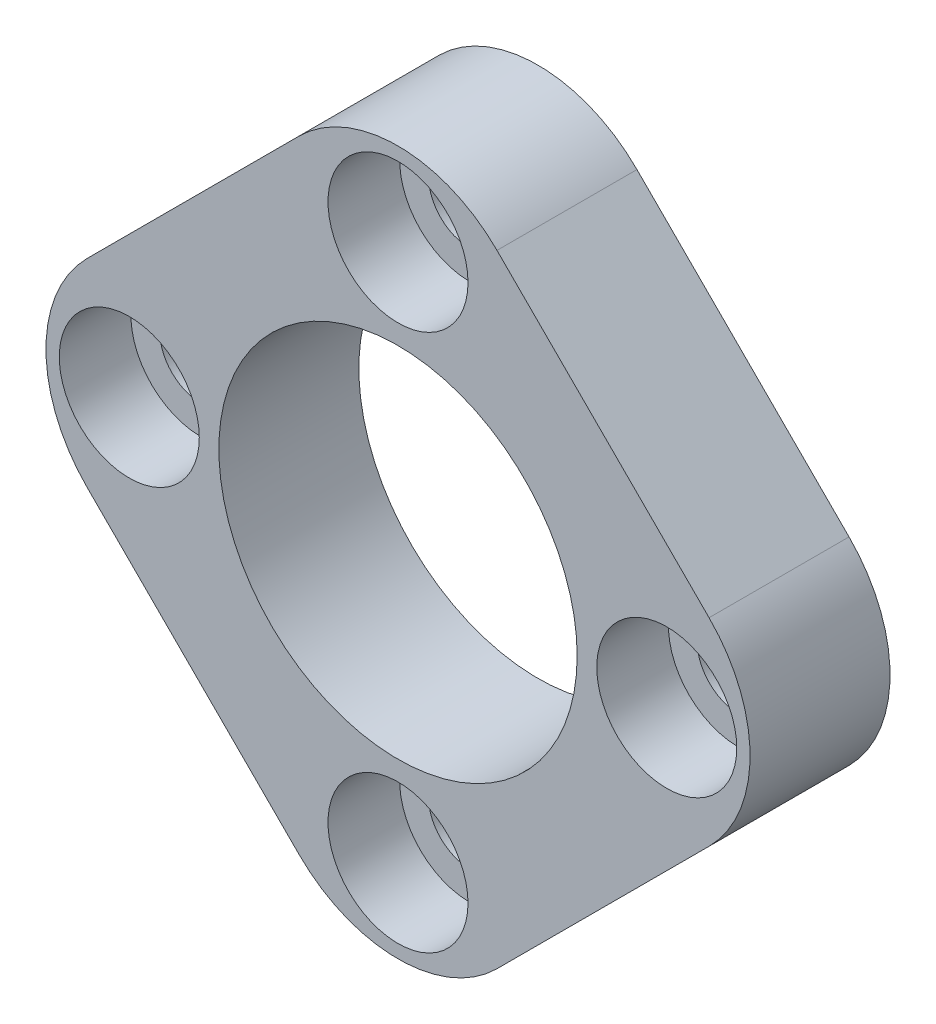
ISO-10303-21;
HEADER;
FILE_DESCRIPTION(('STEP AP214'),'2;1');
FILE_NAME('part.step','',(''),(''),'','','');
FILE_SCHEMA(('AUTOMOTIVE_DESIGN { 1 0 10303 214 1 1 1 1 }'));
ENDSEC;
DATA;
#1=APPLICATION_CONTEXT('core data for automotive mechanical design processes');
#2=APPLICATION_PROTOCOL_DEFINITION('international standard','automotive_design',2000,#1);
#3=PRODUCT_CONTEXT('',#1,'mechanical');
#4=PRODUCT('Part','Part','',(#3));
#5=PRODUCT_RELATED_PRODUCT_CATEGORY('part','',(#4));
#6=PRODUCT_DEFINITION_FORMATION('','',#4);
#7=PRODUCT_DEFINITION_CONTEXT('part definition',#1,'design');
#8=PRODUCT_DEFINITION('design','',#6,#7);
#9=PRODUCT_DEFINITION_SHAPE('','',#8);
#10=(LENGTH_UNIT() NAMED_UNIT(*) SI_UNIT(.MILLI.,.METRE.));
#11=(NAMED_UNIT(*) PLANE_ANGLE_UNIT() SI_UNIT($,.RADIAN.));
#12=(NAMED_UNIT(*) SI_UNIT($,.STERADIAN.) SOLID_ANGLE_UNIT());
#13=UNCERTAINTY_MEASURE_WITH_UNIT(LENGTH_MEASURE(1.E-05),#10,'distance_accuracy_value','');
#14=(GEOMETRIC_REPRESENTATION_CONTEXT(3) GLOBAL_UNCERTAINTY_ASSIGNED_CONTEXT((#13)) GLOBAL_UNIT_ASSIGNED_CONTEXT((#10,
#11,#12)) REPRESENTATION_CONTEXT('',''));
#15=CARTESIAN_POINT('',(0.,0.,0.));
#16=DIRECTION('',(0.,0.,1.));
#17=DIRECTION('',(1.,0.,0.));
#18=AXIS2_PLACEMENT_3D('',#15,#16,#17);
#19=CARTESIAN_POINT('',(0.,-16.2767142194378,-5.55625));
#20=DIRECTION('',(0.707106781186547,-0.707106781186548,0.));
#21=DIRECTION('',(0.707106781186548,0.707106781186547,0.));
#22=AXIS2_PLACEMENT_3D('',#19,#20,#21);
#23=PLANE('',#22);
#24=DIRECTION('',(0.707106781186548,0.707106781186547,0.));
#25=VECTOR('',#24,1.);
#26=CARTESIAN_POINT('',(0.,-16.2767142194378,0.));
#27=LINE('',#26,#25);
#28=CARTESIAN_POINT('',(3.92886205296776,-12.3478521664701,0.));
#29=VERTEX_POINT('',#28);
#30=CARTESIAN_POINT('',(12.3478521664701,-3.92886205296775,0.));
#31=VERTEX_POINT('',#30);
#32=EDGE_CURVE('E168',#29,#31,#27,.T.);
#33=ORIENTED_EDGE('',*,*,#32,.F.);
#34=DIRECTION('',(0.,0.,1.));
#35=VECTOR('',#34,1.);
#36=CARTESIAN_POINT('',(3.92886205296776,-12.3478521664701,-5.55625));
#37=LINE('',#36,#35);
#38=CARTESIAN_POINT('',(3.92886205296776,-12.3478521664701,-5.55625));
#39=VERTEX_POINT('',#38);
#40=EDGE_CURVE('E157',#29,#39,#37,.F.);
#41=ORIENTED_EDGE('',*,*,#40,.T.);
#42=DIRECTION('',(0.707106781186548,0.707106781186547,0.));
#43=VECTOR('',#42,1.);
#44=CARTESIAN_POINT('',(0.,-16.2767142194378,-5.55625));
#45=LINE('',#44,#43);
#46=CARTESIAN_POINT('',(12.3478521664701,-3.92886205296775,-5.55625));
#47=VERTEX_POINT('',#46);
#48=EDGE_CURVE('E161',#39,#47,#45,.T.);
#49=ORIENTED_EDGE('',*,*,#48,.T.);
#50=DIRECTION('',(0.,0.,1.));
#51=VECTOR('',#50,1.);
#52=CARTESIAN_POINT('',(12.3478521664701,-3.92886205296775,-5.55625));
#53=LINE('',#52,#51);
#54=EDGE_CURVE('E154',#47,#31,#53,.T.);
#55=ORIENTED_EDGE('',*,*,#54,.T.);
#56=EDGE_LOOP('',(#33,#41,#49,#55));
#57=FACE_BOUND('',#56,.T.);
#58=ADVANCED_FACE('F44',(#57),#23,.T.);
#59=CARTESIAN_POINT('',(0.,-16.2767142194378,-5.55625));
#60=DIRECTION('',(-0.707106781186547,-0.707106781186547,0.));
#61=DIRECTION('',(0.707106781186548,-0.707106781186548,0.));
#62=AXIS2_PLACEMENT_3D('',#59,#60,#61);
#63=PLANE('',#62);
#64=DIRECTION('',(0.707106781186547,-0.707106781186547,0.));
#65=VECTOR('',#64,1.);
#66=CARTESIAN_POINT('',(0.,-16.2767142194378,0.));
#67=LINE('',#66,#65);
#68=CARTESIAN_POINT('',(-12.3478521664701,-3.92886205296775,0.));
#69=VERTEX_POINT('',#68);
#70=CARTESIAN_POINT('',(-3.92886205296775,-12.3478521664701,0.));
#71=VERTEX_POINT('',#70);
#72=EDGE_CURVE('E127',#69,#71,#67,.T.);
#73=ORIENTED_EDGE('',*,*,#72,.F.);
#74=DIRECTION('',(0.,0.,1.));
#75=VECTOR('',#74,1.);
#76=CARTESIAN_POINT('',(-12.3478521664701,-3.92886205296775,-5.55625));
#77=LINE('',#76,#75);
#78=CARTESIAN_POINT('',(-12.3478521664701,-3.92886205296775,-5.55625));
#79=VERTEX_POINT('',#78);
#80=EDGE_CURVE('E145',#69,#79,#77,.F.);
#81=ORIENTED_EDGE('',*,*,#80,.T.);
#82=DIRECTION('',(0.707106781186547,-0.707106781186547,0.));
#83=VECTOR('',#82,1.);
#84=CARTESIAN_POINT('',(0.,-16.2767142194378,-5.55625));
#85=LINE('',#84,#83);
#86=CARTESIAN_POINT('',(-3.92886205296775,-12.3478521664701,-5.55625));
#87=VERTEX_POINT('',#86);
#88=EDGE_CURVE('E129',#79,#87,#85,.T.);
#89=ORIENTED_EDGE('',*,*,#88,.T.);
#90=DIRECTION('',(0.,0.,1.));
#91=VECTOR('',#90,1.);
#92=CARTESIAN_POINT('',(-3.92886205296775,-12.3478521664701,-5.55625));
#93=LINE('',#92,#91);
#94=EDGE_CURVE('E142',#87,#71,#93,.T.);
#95=ORIENTED_EDGE('',*,*,#94,.T.);
#96=EDGE_LOOP('',(#73,#81,#89,#95));
#97=FACE_BOUND('',#96,.T.);
#98=ADVANCED_FACE('F256',(#97),#63,.T.);
#99=CARTESIAN_POINT('',(-16.2767142194378,0.,-5.55625));
#100=DIRECTION('',(-0.707106781186547,0.707106781186548,0.));
#101=DIRECTION('',(-0.707106781186548,-0.707106781186547,0.));
#102=AXIS2_PLACEMENT_3D('',#99,#100,#101);
#103=PLANE('',#102);
#104=DIRECTION('',(-0.707106781186548,-0.707106781186547,0.));
#105=VECTOR('',#104,1.);
#106=CARTESIAN_POINT('',(-16.2767142194378,0.,-5.55625));
#107=LINE('',#106,#105);
#108=CARTESIAN_POINT('',(-3.92886205296775,12.3478521664701,-5.55625));
#109=VERTEX_POINT('',#108);
#110=CARTESIAN_POINT('',(-12.3478521664701,3.92886205296776,-5.55625));
#111=VERTEX_POINT('',#110);
#112=EDGE_CURVE('E133',#109,#111,#107,.T.);
#113=ORIENTED_EDGE('',*,*,#112,.T.);
#114=DIRECTION('',(0.,0.,1.));
#115=VECTOR('',#114,1.);
#116=CARTESIAN_POINT('',(-12.3478521664701,3.92886205296776,-5.55625));
#117=LINE('',#116,#115);
#118=CARTESIAN_POINT('',(-12.3478521664701,3.92886205296776,0.));
#119=VERTEX_POINT('',#118);
#120=EDGE_CURVE('E119',#111,#119,#117,.T.);
#121=ORIENTED_EDGE('',*,*,#120,.T.);
#122=DIRECTION('',(-0.707106781186548,-0.707106781186547,0.));
#123=VECTOR('',#122,1.);
#124=CARTESIAN_POINT('',(-16.2767142194378,0.,0.));
#125=LINE('',#124,#123);
#126=CARTESIAN_POINT('',(-3.92886205296775,12.3478521664701,0.));
#127=VERTEX_POINT('',#126);
#128=EDGE_CURVE('E112',#127,#119,#125,.T.);
#129=ORIENTED_EDGE('',*,*,#128,.F.);
#130=DIRECTION('',(0.,0.,1.));
#131=VECTOR('',#130,1.);
#132=CARTESIAN_POINT('',(-3.92886205296776,12.3478521664701,-5.55625));
#133=LINE('',#132,#131);
#134=EDGE_CURVE('E125',#127,#109,#133,.F.);
#135=ORIENTED_EDGE('',*,*,#134,.T.);
#136=EDGE_LOOP('',(#113,#121,#129,#135));
#137=FACE_BOUND('',#136,.T.);
#138=ADVANCED_FACE('F124',(#137),#103,.T.);
#139=CARTESIAN_POINT('',(16.2767142194378,0.,-5.55625));
#140=DIRECTION('',(0.707106781186547,0.707106781186547,0.));
#141=DIRECTION('',(-0.707106781186548,0.707106781186548,0.));
#142=AXIS2_PLACEMENT_3D('',#139,#140,#141);
#143=PLANE('',#142);
#144=DIRECTION('',(-0.707106781186547,0.707106781186547,0.));
#145=VECTOR('',#144,1.);
#146=CARTESIAN_POINT('',(16.2767142194378,0.,0.));
#147=LINE('',#146,#145);
#148=CARTESIAN_POINT('',(12.3478521664701,3.92886205296775,0.));
#149=VERTEX_POINT('',#148);
#150=CARTESIAN_POINT('',(3.92886205296776,12.3478521664701,0.));
#151=VERTEX_POINT('',#150);
#152=EDGE_CURVE('E113',#149,#151,#147,.T.);
#153=ORIENTED_EDGE('',*,*,#152,.F.);
#154=DIRECTION('',(0.,0.,1.));
#155=VECTOR('',#154,1.);
#156=CARTESIAN_POINT('',(12.3478521664701,3.92886205296775,-5.55625));
#157=LINE('',#156,#155);
#158=CARTESIAN_POINT('',(12.3478521664701,3.92886205296775,-5.55625));
#159=VERTEX_POINT('',#158);
#160=EDGE_CURVE('E13',#149,#159,#157,.F.);
#161=ORIENTED_EDGE('',*,*,#160,.T.);
#162=DIRECTION('',(-0.707106781186547,0.707106781186547,0.));
#163=VECTOR('',#162,1.);
#164=CARTESIAN_POINT('',(16.2767142194378,0.,-5.55625));
#165=LINE('',#164,#163);
#166=CARTESIAN_POINT('',(3.92886205296776,12.3478521664701,-5.55625));
#167=VERTEX_POINT('',#166);
#168=EDGE_CURVE('E159',#159,#167,#165,.T.);
#169=ORIENTED_EDGE('',*,*,#168,.T.);
#170=DIRECTION('',(0.,0.,1.));
#171=VECTOR('',#170,1.);
#172=CARTESIAN_POINT('',(3.92886205296776,12.3478521664701,-5.55625));
#173=LINE('',#172,#171);
#174=EDGE_CURVE('E52',#167,#151,#173,.T.);
#175=ORIENTED_EDGE('',*,*,#174,.T.);
#176=EDGE_LOOP('',(#153,#161,#169,#175));
#177=FACE_BOUND('',#176,.T.);
#178=ADVANCED_FACE('F158',(#177),#143,.T.);
#179=CARTESIAN_POINT('',(16.2767142194378,0.,-5.55625));
#180=DIRECTION('',(0.,0.,1.));
#181=DIRECTION('',(1.,0.,0.));
#182=AXIS2_PLACEMENT_3D('',#179,#180,#181);
#183=PLANE('',#182);
#184=CARTESIAN_POINT('',(10.668,1.11741368768336E-13,-5.55625));
#185=DIRECTION('',(0.,0.,1.));
#186=DIRECTION('',(1.,0.,0.));
#187=AXIS2_PLACEMENT_3D('',#184,#185,#186);
#188=CIRCLE('',#187,1.63195);
#189=CARTESIAN_POINT('',(12.29995,1.11741368768336E-13,-5.55625));
#190=VERTEX_POINT('',#189);
#191=EDGE_CURVE('E216',#190,#190,#188,.T.);
#192=ORIENTED_EDGE('',*,*,#191,.T.);
#193=EDGE_LOOP('',(#192));
#194=FACE_BOUND('',#193,.T.);
#195=CARTESIAN_POINT('',(0.,-10.668,-5.55625));
#196=DIRECTION('',(0.,0.,1.));
#197=DIRECTION('',(1.,0.,0.));
#198=AXIS2_PLACEMENT_3D('',#195,#196,#197);
#199=CIRCLE('',#198,1.63195);
#200=CARTESIAN_POINT('',(1.63195,-10.668,-5.55625));
#201=VERTEX_POINT('',#200);
#202=EDGE_CURVE('E204',#201,#201,#199,.T.);
#203=ORIENTED_EDGE('',*,*,#202,.T.);
#204=EDGE_LOOP('',(#203));
#205=FACE_BOUND('',#204,.T.);
#206=CARTESIAN_POINT('',(-10.668,0.,-5.55625));
#207=DIRECTION('',(0.,0.,1.));
#208=DIRECTION('',(1.,0.,0.));
#209=AXIS2_PLACEMENT_3D('',#206,#207,#208);
#210=CIRCLE('',#209,1.63195);
#211=CARTESIAN_POINT('',(-9.03605,0.,-5.55625));
#212=VERTEX_POINT('',#211);
#213=EDGE_CURVE('E192',#212,#212,#210,.T.);
#214=ORIENTED_EDGE('',*,*,#213,.T.);
#215=EDGE_LOOP('',(#214));
#216=FACE_BOUND('',#215,.T.);
#217=CARTESIAN_POINT('',(0.,10.668,-5.55625));
#218=DIRECTION('',(0.,0.,1.));
#219=DIRECTION('',(1.,0.,0.));
#220=AXIS2_PLACEMENT_3D('',#217,#218,#219);
#221=CIRCLE('',#220,1.63195);
#222=CARTESIAN_POINT('',(1.63195,10.668,-5.55625));
#223=VERTEX_POINT('',#222);
#224=EDGE_CURVE('E179',#223,#223,#221,.T.);
#225=ORIENTED_EDGE('',*,*,#224,.T.);
#226=EDGE_LOOP('',(#225));
#227=FACE_BOUND('',#226,.T.);
#228=CARTESIAN_POINT('',(0.,0.,-5.55625));
#229=DIRECTION('',(0.,0.,1.));
#230=DIRECTION('',(1.,0.,0.));
#231=AXIS2_PLACEMENT_3D('',#228,#229,#230);
#232=CIRCLE('',#231,7.112);
#233=CARTESIAN_POINT('',(7.112,0.,-5.55625));
#234=VERTEX_POINT('',#233);
#235=EDGE_CURVE('E171',#234,#234,#232,.T.);
#236=ORIENTED_EDGE('',*,*,#235,.T.);
#237=EDGE_LOOP('',(#236));
#238=FACE_BOUND('',#237,.T.);
#239=ORIENTED_EDGE('',*,*,#88,.F.);
#240=CARTESIAN_POINT('',(-8.41899011350233,0.,-5.55625));
#241=DIRECTION('',(0.,0.,1.));
#242=DIRECTION('',(1.,0.,0.));
#243=AXIS2_PLACEMENT_3D('',#240,#241,#242);
#244=CIRCLE('',#243,5.55625);
#245=EDGE_CURVE('E152',#79,#111,#244,.F.);
#246=ORIENTED_EDGE('',*,*,#245,.T.);
#247=ORIENTED_EDGE('',*,*,#112,.F.);
#248=CARTESIAN_POINT('',(0.,8.41899011350234,-5.55625));
#249=DIRECTION('',(0.,0.,1.));
#250=DIRECTION('',(1.,0.,0.));
#251=AXIS2_PLACEMENT_3D('',#248,#249,#250);
#252=CIRCLE('',#251,5.55625);
#253=EDGE_CURVE('E59',#109,#167,#252,.F.);
#254=ORIENTED_EDGE('',*,*,#253,.T.);
#255=ORIENTED_EDGE('',*,*,#168,.F.);
#256=CARTESIAN_POINT('',(8.41899011350234,0.,-5.55625));
#257=DIRECTION('',(0.,0.,1.));
#258=DIRECTION('',(1.,0.,0.));
#259=AXIS2_PLACEMENT_3D('',#256,#257,#258);
#260=CIRCLE('',#259,5.55625);
#261=EDGE_CURVE('E148',#159,#47,#260,.F.);
#262=ORIENTED_EDGE('',*,*,#261,.T.);
#263=ORIENTED_EDGE('',*,*,#48,.F.);
#264=CARTESIAN_POINT('',(0.,-8.41899011350233,-5.55625));
#265=DIRECTION('',(0.,0.,1.));
#266=DIRECTION('',(1.,0.,0.));
#267=AXIS2_PLACEMENT_3D('',#264,#265,#266);
#268=CIRCLE('',#267,5.55625);
#269=EDGE_CURVE('E150',#39,#87,#268,.F.);
#270=ORIENTED_EDGE('',*,*,#269,.T.);
#271=EDGE_LOOP('',(#239,#246,#247,#254,#255,#262,#263,#270));
#272=FACE_BOUND('',#271,.T.);
#273=ADVANCED_FACE('F234',(#194,#205,#216,#227,#238,#272),#183,.F.);
#274=CARTESIAN_POINT('',(16.2767142194378,0.,0.));
#275=DIRECTION('',(0.,0.,1.));
#276=DIRECTION('',(1.,0.,0.));
#277=AXIS2_PLACEMENT_3D('',#274,#275,#276);
#278=PLANE('',#277);
#279=CARTESIAN_POINT('',(10.668,1.11741368768336E-13,0.));
#280=DIRECTION('',(0.,0.,1.));
#281=DIRECTION('',(1.,0.,0.));
#282=AXIS2_PLACEMENT_3D('',#279,#280,#281);
#283=CIRCLE('',#282,2.77876);
#284=CARTESIAN_POINT('',(13.44676,1.11741368768336E-13,0.));
#285=VERTEX_POINT('',#284);
#286=EDGE_CURVE('E225',#285,#285,#283,.T.);
#287=ORIENTED_EDGE('',*,*,#286,.F.);
#288=EDGE_LOOP('',(#287));
#289=FACE_BOUND('',#288,.T.);
#290=CARTESIAN_POINT('',(0.,-10.668,0.));
#291=DIRECTION('',(0.,0.,1.));
#292=DIRECTION('',(1.,0.,0.));
#293=AXIS2_PLACEMENT_3D('',#290,#291,#292);
#294=CIRCLE('',#293,2.77876);
#295=CARTESIAN_POINT('',(2.77876,-10.668,0.));
#296=VERTEX_POINT('',#295);
#297=EDGE_CURVE('E213',#296,#296,#294,.T.);
#298=ORIENTED_EDGE('',*,*,#297,.F.);
#299=EDGE_LOOP('',(#298));
#300=FACE_BOUND('',#299,.T.);
#301=CARTESIAN_POINT('',(-10.668,0.,0.));
#302=DIRECTION('',(0.,0.,1.));
#303=DIRECTION('',(1.,0.,0.));
#304=AXIS2_PLACEMENT_3D('',#301,#302,#303);
#305=CIRCLE('',#304,2.77876);
#306=CARTESIAN_POINT('',(-7.88924,0.,0.));
#307=VERTEX_POINT('',#306);
#308=EDGE_CURVE('E201',#307,#307,#305,.T.);
#309=ORIENTED_EDGE('',*,*,#308,.F.);
#310=EDGE_LOOP('',(#309));
#311=FACE_BOUND('',#310,.T.);
#312=CARTESIAN_POINT('',(0.,10.668,0.));
#313=DIRECTION('',(0.,0.,1.));
#314=DIRECTION('',(1.,0.,0.));
#315=AXIS2_PLACEMENT_3D('',#312,#313,#314);
#316=CIRCLE('',#315,2.77876);
#317=CARTESIAN_POINT('',(2.77876,10.668,0.));
#318=VERTEX_POINT('',#317);
#319=EDGE_CURVE('E189',#318,#318,#316,.T.);
#320=ORIENTED_EDGE('',*,*,#319,.F.);
#321=EDGE_LOOP('',(#320));
#322=FACE_BOUND('',#321,.T.);
#323=CARTESIAN_POINT('',(0.,0.,0.));
#324=DIRECTION('',(0.,0.,1.));
#325=DIRECTION('',(1.,0.,0.));
#326=AXIS2_PLACEMENT_3D('',#323,#324,#325);
#327=CIRCLE('',#326,7.112);
#328=CARTESIAN_POINT('',(7.112,0.,0.));
#329=VERTEX_POINT('',#328);
#330=EDGE_CURVE('E174',#329,#329,#327,.T.);
#331=ORIENTED_EDGE('',*,*,#330,.F.);
#332=EDGE_LOOP('',(#331));
#333=FACE_BOUND('',#332,.T.);
#334=ORIENTED_EDGE('',*,*,#128,.T.);
#335=CARTESIAN_POINT('',(-8.41899011350233,0.,0.));
#336=DIRECTION('',(0.,0.,1.));
#337=DIRECTION('',(1.,0.,0.));
#338=AXIS2_PLACEMENT_3D('',#335,#336,#337);
#339=CIRCLE('',#338,5.55625);
#340=EDGE_CURVE('E140',#119,#69,#339,.T.);
#341=ORIENTED_EDGE('',*,*,#340,.T.);
#342=ORIENTED_EDGE('',*,*,#72,.T.);
#343=CARTESIAN_POINT('',(0.,-8.41899011350233,0.));
#344=DIRECTION('',(0.,0.,1.));
#345=DIRECTION('',(1.,0.,0.));
#346=AXIS2_PLACEMENT_3D('',#343,#344,#345);
#347=CIRCLE('',#346,5.55625);
#348=EDGE_CURVE('E138',#71,#29,#347,.T.);
#349=ORIENTED_EDGE('',*,*,#348,.T.);
#350=ORIENTED_EDGE('',*,*,#32,.T.);
#351=CARTESIAN_POINT('',(8.41899011350234,0.,0.));
#352=DIRECTION('',(0.,0.,1.));
#353=DIRECTION('',(1.,0.,0.));
#354=AXIS2_PLACEMENT_3D('',#351,#352,#353);
#355=CIRCLE('',#354,5.55625);
#356=EDGE_CURVE('E118',#31,#149,#355,.T.);
#357=ORIENTED_EDGE('',*,*,#356,.T.);
#358=ORIENTED_EDGE('',*,*,#152,.T.);
#359=CARTESIAN_POINT('',(0.,8.41899011350234,0.));
#360=DIRECTION('',(0.,0.,1.));
#361=DIRECTION('',(1.,0.,0.));
#362=AXIS2_PLACEMENT_3D('',#359,#360,#361);
#363=CIRCLE('',#362,5.55625);
#364=EDGE_CURVE('E109',#151,#127,#363,.T.);
#365=ORIENTED_EDGE('',*,*,#364,.T.);
#366=EDGE_LOOP('',(#334,#341,#342,#349,#350,#357,#358,#365));
#367=FACE_BOUND('',#366,.T.);
#368=ADVANCED_FACE('F111',(#289,#300,#311,#322,#333,#367),#278,.T.);
#369=CARTESIAN_POINT('',(0.,0.,-5.55625));
#370=DIRECTION('',(0.,0.,1.));
#371=DIRECTION('',(1.,0.,0.));
#372=AXIS2_PLACEMENT_3D('',#369,#370,#371);
#373=CYLINDRICAL_SURFACE('',#372,7.112);
#374=ORIENTED_EDGE('',*,*,#235,.F.);
#375=EDGE_LOOP('',(#374));
#376=FACE_BOUND('',#375,.T.);
#377=ORIENTED_EDGE('',*,*,#330,.T.);
#378=EDGE_LOOP('',(#377));
#379=FACE_BOUND('',#378,.T.);
#380=ADVANCED_FACE('F233',(#376,#379),#373,.F.);
#381=CARTESIAN_POINT('',(0.,10.668,0.));
#382=DIRECTION('',(0.,0.,1.));
#383=DIRECTION('',(1.,0.,0.));
#384=AXIS2_PLACEMENT_3D('',#381,#382,#383);
#385=CYLINDRICAL_SURFACE('',#384,1.63195);
#386=ORIENTED_EDGE('',*,*,#224,.F.);
#387=EDGE_LOOP('',(#386));
#388=FACE_BOUND('',#387,.T.);
#389=CARTESIAN_POINT('',(0.,10.668,-2.8448));
#390=DIRECTION('',(0.,0.,1.));
#391=DIRECTION('',(1.,0.,0.));
#392=AXIS2_PLACEMENT_3D('',#389,#390,#391);
#393=CIRCLE('',#392,1.63195);
#394=CARTESIAN_POINT('',(1.63195,10.668,-2.8448));
#395=VERTEX_POINT('',#394);
#396=EDGE_CURVE('E183',#395,#395,#393,.T.);
#397=ORIENTED_EDGE('',*,*,#396,.T.);
#398=EDGE_LOOP('',(#397));
#399=FACE_BOUND('',#398,.T.);
#400=ADVANCED_FACE('F245',(#388,#399),#385,.F.);
#401=CARTESIAN_POINT('',(1.63195,10.668,-2.8448));
#402=DIRECTION('',(0.,0.,-1.));
#403=DIRECTION('',(-1.,0.,0.));
#404=AXIS2_PLACEMENT_3D('',#401,#402,#403);
#405=PLANE('',#404);
#406=ORIENTED_EDGE('',*,*,#396,.F.);
#407=EDGE_LOOP('',(#406));
#408=FACE_BOUND('',#407,.T.);
#409=CARTESIAN_POINT('',(0.,10.668,-2.8448));
#410=DIRECTION('',(0.,0.,1.));
#411=DIRECTION('',(1.,0.,0.));
#412=AXIS2_PLACEMENT_3D('',#409,#410,#411);
#413=CIRCLE('',#412,2.77876);
#414=CARTESIAN_POINT('',(2.77876,10.668,-2.8448));
#415=VERTEX_POINT('',#414);
#416=EDGE_CURVE('E186',#415,#415,#413,.T.);
#417=ORIENTED_EDGE('',*,*,#416,.T.);
#418=EDGE_LOOP('',(#417));
#419=FACE_BOUND('',#418,.T.);
#420=ADVANCED_FACE('F251',(#408,#419),#405,.F.);
#421=CARTESIAN_POINT('',(0.,10.668,0.));
#422=DIRECTION('',(0.,0.,1.));
#423=DIRECTION('',(1.,0.,0.));
#424=AXIS2_PLACEMENT_3D('',#421,#422,#423);
#425=CYLINDRICAL_SURFACE('',#424,2.77876);
#426=ORIENTED_EDGE('',*,*,#416,.F.);
#427=EDGE_LOOP('',(#426));
#428=FACE_BOUND('',#427,.T.);
#429=ORIENTED_EDGE('',*,*,#319,.T.);
#430=EDGE_LOOP('',(#429));
#431=FACE_BOUND('',#430,.T.);
#432=ADVANCED_FACE('F410',(#428,#431),#425,.F.);
#433=CARTESIAN_POINT('',(-10.668,0.,0.));
#434=DIRECTION('',(0.,0.,1.));
#435=DIRECTION('',(1.,0.,0.));
#436=AXIS2_PLACEMENT_3D('',#433,#434,#435);
#437=CYLINDRICAL_SURFACE('',#436,1.63195);
#438=ORIENTED_EDGE('',*,*,#213,.F.);
#439=EDGE_LOOP('',(#438));
#440=FACE_BOUND('',#439,.T.);
#441=CARTESIAN_POINT('',(-10.668,0.,-2.8448));
#442=DIRECTION('',(0.,0.,1.));
#443=DIRECTION('',(1.,0.,0.));
#444=AXIS2_PLACEMENT_3D('',#441,#442,#443);
#445=CIRCLE('',#444,1.63195);
#446=CARTESIAN_POINT('',(-9.03605,0.,-2.8448));
#447=VERTEX_POINT('',#446);
#448=EDGE_CURVE('E195',#447,#447,#445,.T.);
#449=ORIENTED_EDGE('',*,*,#448,.T.);
#450=EDGE_LOOP('',(#449));
#451=FACE_BOUND('',#450,.T.);
#452=ADVANCED_FACE('F402',(#440,#451),#437,.F.);
#453=CARTESIAN_POINT('',(-9.03605,0.,-2.8448));
#454=DIRECTION('',(0.,0.,-1.));
#455=DIRECTION('',(-1.,0.,0.));
#456=AXIS2_PLACEMENT_3D('',#453,#454,#455);
#457=PLANE('',#456);
#458=ORIENTED_EDGE('',*,*,#448,.F.);
#459=EDGE_LOOP('',(#458));
#460=FACE_BOUND('',#459,.T.);
#461=CARTESIAN_POINT('',(-10.668,0.,-2.8448));
#462=DIRECTION('',(0.,0.,1.));
#463=DIRECTION('',(1.,0.,0.));
#464=AXIS2_PLACEMENT_3D('',#461,#462,#463);
#465=CIRCLE('',#464,2.77876);
#466=CARTESIAN_POINT('',(-7.88924,0.,-2.8448));
#467=VERTEX_POINT('',#466);
#468=EDGE_CURVE('E198',#467,#467,#465,.T.);
#469=ORIENTED_EDGE('',*,*,#468,.T.);
#470=EDGE_LOOP('',(#469));
#471=FACE_BOUND('',#470,.T.);
#472=ADVANCED_FACE('F394',(#460,#471),#457,.F.);
#473=CARTESIAN_POINT('',(-10.668,0.,0.));
#474=DIRECTION('',(0.,0.,1.));
#475=DIRECTION('',(1.,0.,0.));
#476=AXIS2_PLACEMENT_3D('',#473,#474,#475);
#477=CYLINDRICAL_SURFACE('',#476,2.77876);
#478=ORIENTED_EDGE('',*,*,#468,.F.);
#479=EDGE_LOOP('',(#478));
#480=FACE_BOUND('',#479,.T.);
#481=ORIENTED_EDGE('',*,*,#308,.T.);
#482=EDGE_LOOP('',(#481));
#483=FACE_BOUND('',#482,.T.);
#484=ADVANCED_FACE('F386',(#480,#483),#477,.F.);
#485=CARTESIAN_POINT('',(0.,-10.668,0.));
#486=DIRECTION('',(0.,0.,1.));
#487=DIRECTION('',(1.,0.,0.));
#488=AXIS2_PLACEMENT_3D('',#485,#486,#487);
#489=CYLINDRICAL_SURFACE('',#488,1.63195);
#490=ORIENTED_EDGE('',*,*,#202,.F.);
#491=EDGE_LOOP('',(#490));
#492=FACE_BOUND('',#491,.T.);
#493=CARTESIAN_POINT('',(0.,-10.668,-2.8448));
#494=DIRECTION('',(0.,0.,1.));
#495=DIRECTION('',(1.,0.,0.));
#496=AXIS2_PLACEMENT_3D('',#493,#494,#495);
#497=CIRCLE('',#496,1.63195);
#498=CARTESIAN_POINT('',(1.63195,-10.668,-2.8448));
#499=VERTEX_POINT('',#498);
#500=EDGE_CURVE('E207',#499,#499,#497,.T.);
#501=ORIENTED_EDGE('',*,*,#500,.T.);
#502=EDGE_LOOP('',(#501));
#503=FACE_BOUND('',#502,.T.);
#504=ADVANCED_FACE('F378',(#492,#503),#489,.F.);
#505=CARTESIAN_POINT('',(1.63195,-10.668,-2.8448));
#506=DIRECTION('',(0.,0.,-1.));
#507=DIRECTION('',(-1.,0.,0.));
#508=AXIS2_PLACEMENT_3D('',#505,#506,#507);
#509=PLANE('',#508);
#510=ORIENTED_EDGE('',*,*,#500,.F.);
#511=EDGE_LOOP('',(#510));
#512=FACE_BOUND('',#511,.T.);
#513=CARTESIAN_POINT('',(0.,-10.668,-2.8448));
#514=DIRECTION('',(0.,0.,1.));
#515=DIRECTION('',(1.,0.,0.));
#516=AXIS2_PLACEMENT_3D('',#513,#514,#515);
#517=CIRCLE('',#516,2.77876);
#518=CARTESIAN_POINT('',(2.77876,-10.668,-2.8448));
#519=VERTEX_POINT('',#518);
#520=EDGE_CURVE('E210',#519,#519,#517,.T.);
#521=ORIENTED_EDGE('',*,*,#520,.T.);
#522=EDGE_LOOP('',(#521));
#523=FACE_BOUND('',#522,.T.);
#524=ADVANCED_FACE('F370',(#512,#523),#509,.F.);
#525=CARTESIAN_POINT('',(0.,-10.668,0.));
#526=DIRECTION('',(0.,0.,1.));
#527=DIRECTION('',(1.,0.,0.));
#528=AXIS2_PLACEMENT_3D('',#525,#526,#527);
#529=CYLINDRICAL_SURFACE('',#528,2.77876);
#530=ORIENTED_EDGE('',*,*,#520,.F.);
#531=EDGE_LOOP('',(#530));
#532=FACE_BOUND('',#531,.T.);
#533=ORIENTED_EDGE('',*,*,#297,.T.);
#534=EDGE_LOOP('',(#533));
#535=FACE_BOUND('',#534,.T.);
#536=ADVANCED_FACE('F362',(#532,#535),#529,.F.);
#537=CARTESIAN_POINT('',(10.668,1.11741368768336E-13,0.));
#538=DIRECTION('',(0.,0.,1.));
#539=DIRECTION('',(1.,0.,0.));
#540=AXIS2_PLACEMENT_3D('',#537,#538,#539);
#541=CYLINDRICAL_SURFACE('',#540,1.63195);
#542=ORIENTED_EDGE('',*,*,#191,.F.);
#543=EDGE_LOOP('',(#542));
#544=FACE_BOUND('',#543,.T.);
#545=CARTESIAN_POINT('',(10.668,1.11741368768336E-13,-2.8448));
#546=DIRECTION('',(0.,0.,1.));
#547=DIRECTION('',(1.,0.,0.));
#548=AXIS2_PLACEMENT_3D('',#545,#546,#547);
#549=CIRCLE('',#548,1.63195);
#550=CARTESIAN_POINT('',(12.29995,1.11741368768336E-13,-2.8448));
#551=VERTEX_POINT('',#550);
#552=EDGE_CURVE('E219',#551,#551,#549,.T.);
#553=ORIENTED_EDGE('',*,*,#552,.T.);
#554=EDGE_LOOP('',(#553));
#555=FACE_BOUND('',#554,.T.);
#556=ADVANCED_FACE('F354',(#544,#555),#541,.F.);
#557=CARTESIAN_POINT('',(12.29995,1.11741368768336E-13,-2.8448));
#558=DIRECTION('',(0.,0.,-1.));
#559=DIRECTION('',(-1.,0.,0.));
#560=AXIS2_PLACEMENT_3D('',#557,#558,#559);
#561=PLANE('',#560);
#562=ORIENTED_EDGE('',*,*,#552,.F.);
#563=EDGE_LOOP('',(#562));
#564=FACE_BOUND('',#563,.T.);
#565=CARTESIAN_POINT('',(10.668,1.11741368768336E-13,-2.8448));
#566=DIRECTION('',(0.,0.,1.));
#567=DIRECTION('',(1.,0.,0.));
#568=AXIS2_PLACEMENT_3D('',#565,#566,#567);
#569=CIRCLE('',#568,2.77876);
#570=CARTESIAN_POINT('',(13.44676,1.11741368768336E-13,-2.8448));
#571=VERTEX_POINT('',#570);
#572=EDGE_CURVE('E222',#571,#571,#569,.T.);
#573=ORIENTED_EDGE('',*,*,#572,.T.);
#574=EDGE_LOOP('',(#573));
#575=FACE_BOUND('',#574,.T.);
#576=ADVANCED_FACE('F347',(#564,#575),#561,.F.);
#577=CARTESIAN_POINT('',(10.668,1.11741368768336E-13,0.));
#578=DIRECTION('',(0.,0.,1.));
#579=DIRECTION('',(1.,0.,0.));
#580=AXIS2_PLACEMENT_3D('',#577,#578,#579);
#581=CYLINDRICAL_SURFACE('',#580,2.77876);
#582=ORIENTED_EDGE('',*,*,#572,.F.);
#583=EDGE_LOOP('',(#582));
#584=FACE_BOUND('',#583,.T.);
#585=ORIENTED_EDGE('',*,*,#286,.T.);
#586=EDGE_LOOP('',(#585));
#587=FACE_BOUND('',#586,.T.);
#588=ADVANCED_FACE('F229',(#584,#587),#581,.F.);
#589=CARTESIAN_POINT('',(-8.41899011350233,0.,-5.55625));
#590=DIRECTION('',(0.,0.,1.));
#591=DIRECTION('',(1.,0.,0.));
#592=AXIS2_PLACEMENT_3D('',#589,#590,#591);
#593=CYLINDRICAL_SURFACE('',#592,5.55625);
#594=ORIENTED_EDGE('',*,*,#245,.F.);
#595=ORIENTED_EDGE('',*,*,#80,.F.);
#596=ORIENTED_EDGE('',*,*,#340,.F.);
#597=ORIENTED_EDGE('',*,*,#120,.F.);
#598=EDGE_LOOP('',(#594,#595,#596,#597));
#599=FACE_BOUND('',#598,.T.);
#600=ADVANCED_FACE('F267',(#599),#593,.T.);
#601=CARTESIAN_POINT('',(0.,-8.41899011350233,-5.55625));
#602=DIRECTION('',(0.,0.,1.));
#603=DIRECTION('',(1.,0.,0.));
#604=AXIS2_PLACEMENT_3D('',#601,#602,#603);
#605=CYLINDRICAL_SURFACE('',#604,5.55625);
#606=ORIENTED_EDGE('',*,*,#269,.F.);
#607=ORIENTED_EDGE('',*,*,#40,.F.);
#608=ORIENTED_EDGE('',*,*,#348,.F.);
#609=ORIENTED_EDGE('',*,*,#94,.F.);
#610=EDGE_LOOP('',(#606,#607,#608,#609));
#611=FACE_BOUND('',#610,.T.);
#612=ADVANCED_FACE('F270',(#611),#605,.T.);
#613=CARTESIAN_POINT('',(8.41899011350234,0.,-5.55625));
#614=DIRECTION('',(0.,0.,1.));
#615=DIRECTION('',(1.,0.,0.));
#616=AXIS2_PLACEMENT_3D('',#613,#614,#615);
#617=CYLINDRICAL_SURFACE('',#616,5.55625);
#618=ORIENTED_EDGE('',*,*,#261,.F.);
#619=ORIENTED_EDGE('',*,*,#160,.F.);
#620=ORIENTED_EDGE('',*,*,#356,.F.);
#621=ORIENTED_EDGE('',*,*,#54,.F.);
#622=EDGE_LOOP('',(#618,#619,#620,#621));
#623=FACE_BOUND('',#622,.T.);
#624=ADVANCED_FACE('F273',(#623),#617,.T.);
#625=CARTESIAN_POINT('',(0.,8.41899011350234,-5.55625));
#626=DIRECTION('',(0.,0.,1.));
#627=DIRECTION('',(1.,0.,0.));
#628=AXIS2_PLACEMENT_3D('',#625,#626,#627);
#629=CYLINDRICAL_SURFACE('',#628,5.55625);
#630=ORIENTED_EDGE('',*,*,#253,.F.);
#631=ORIENTED_EDGE('',*,*,#134,.F.);
#632=ORIENTED_EDGE('',*,*,#364,.F.);
#633=ORIENTED_EDGE('',*,*,#174,.F.);
#634=EDGE_LOOP('',(#630,#631,#632,#633));
#635=FACE_BOUND('',#634,.T.);
#636=ADVANCED_FACE('F46',(#635),#629,.T.);
#637=CLOSED_SHELL('',(#58,#98,#138,#178,#273,#368,#380,#400,#420,#432,#452,#472,#484,#504,#524,
#536,#556,#576,#588,#600,#612,#624,#636));
#638=MANIFOLD_SOLID_BREP('B2',#637);
#639=ADVANCED_BREP_SHAPE_REPRESENTATION('',(#18,#638),#14);
#640=SHAPE_DEFINITION_REPRESENTATION(#9,#639);
ENDSEC;
END-ISO-10303-21;
